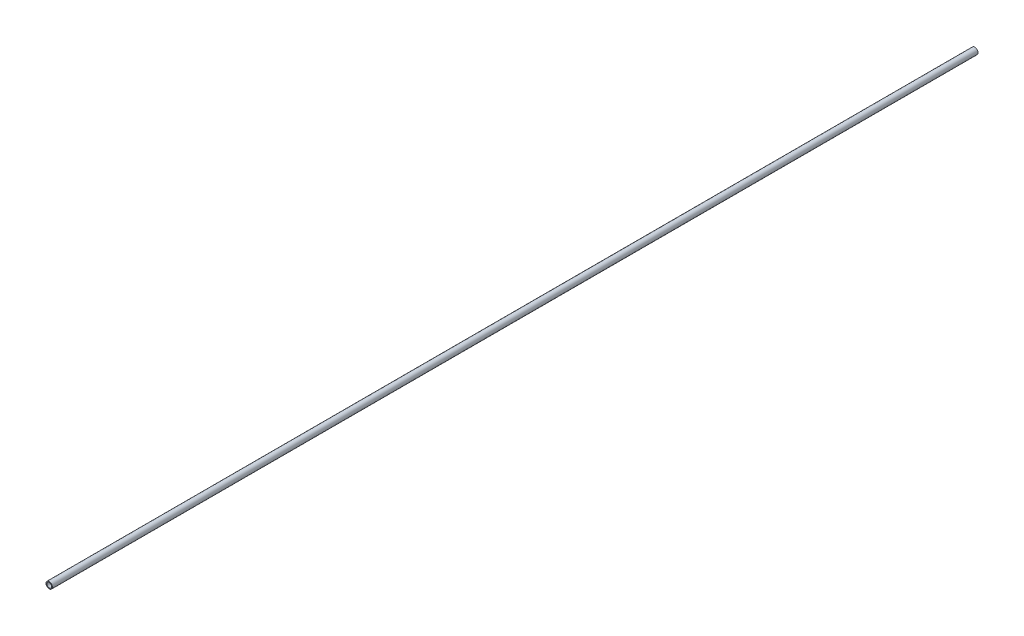
ISO-10303-21;
HEADER;
FILE_DESCRIPTION(('STEP AP214'),'2;1');
FILE_NAME('part.step','',(''),(''),'','','');
FILE_SCHEMA(('AUTOMOTIVE_DESIGN { 1 0 10303 214 1 1 1 1 }'));
ENDSEC;
DATA;
#1=APPLICATION_CONTEXT('core data for automotive mechanical design processes');
#2=APPLICATION_PROTOCOL_DEFINITION('international standard','automotive_design',2000,#1);
#3=PRODUCT_CONTEXT('',#1,'mechanical');
#4=PRODUCT('Part','Part','',(#3));
#5=PRODUCT_RELATED_PRODUCT_CATEGORY('part','',(#4));
#6=PRODUCT_DEFINITION_FORMATION('','',#4);
#7=PRODUCT_DEFINITION_CONTEXT('part definition',#1,'design');
#8=PRODUCT_DEFINITION('design','',#6,#7);
#9=PRODUCT_DEFINITION_SHAPE('','',#8);
#10=(LENGTH_UNIT() NAMED_UNIT(*) SI_UNIT(.MILLI.,.METRE.));
#11=(NAMED_UNIT(*) PLANE_ANGLE_UNIT() SI_UNIT($,.RADIAN.));
#12=(NAMED_UNIT(*) SI_UNIT($,.STERADIAN.) SOLID_ANGLE_UNIT());
#13=UNCERTAINTY_MEASURE_WITH_UNIT(LENGTH_MEASURE(1.E-05),#10,'distance_accuracy_value','');
#14=(GEOMETRIC_REPRESENTATION_CONTEXT(3) GLOBAL_UNCERTAINTY_ASSIGNED_CONTEXT((#13)) GLOBAL_UNIT_ASSIGNED_CONTEXT((#10,
#11,#12)) REPRESENTATION_CONTEXT('',''));
#15=CARTESIAN_POINT('',(0.,0.,0.));
#16=DIRECTION('',(0.,0.,1.));
#17=DIRECTION('',(1.,0.,0.));
#18=AXIS2_PLACEMENT_3D('',#15,#16,#17);
#19=CARTESIAN_POINT('',(0.,0.,1828.8));
#20=DIRECTION('',(0.,0.,1.));
#21=DIRECTION('',(1.,0.,0.));
#22=AXIS2_PLACEMENT_3D('',#19,#20,#21);
#23=PLANE('',#22);
#24=CARTESIAN_POINT('',(0.,0.,1828.8));
#25=DIRECTION('',(0.,0.,1.));
#26=DIRECTION('',(1.,0.,0.));
#27=AXIS2_PLACEMENT_3D('',#24,#25,#26);
#28=CIRCLE('',#27,6.35);
#29=CARTESIAN_POINT('',(6.35,0.,1828.8));
#30=VERTEX_POINT('',#29);
#31=EDGE_CURVE('E10',#30,#30,#28,.T.);
#32=ORIENTED_EDGE('',*,*,#31,.T.);
#33=EDGE_LOOP('',(#32));
#34=FACE_BOUND('',#33,.T.);
#35=CARTESIAN_POINT('',(0.,0.,1828.8));
#36=DIRECTION('',(0.,0.,1.));
#37=DIRECTION('',(1.,0.,0.));
#38=AXIS2_PLACEMENT_3D('',#35,#36,#37);
#39=CIRCLE('',#38,4.699);
#40=CARTESIAN_POINT('',(4.699,0.,1828.8));
#41=VERTEX_POINT('',#40);
#42=EDGE_CURVE('E42',#41,#41,#39,.T.);
#43=ORIENTED_EDGE('',*,*,#42,.F.);
#44=EDGE_LOOP('',(#43));
#45=FACE_BOUND('',#44,.T.);
#46=ADVANCED_FACE('F31',(#34,#45),#23,.T.);
#47=CARTESIAN_POINT('',(0.,0.,0.));
#48=DIRECTION('',(0.,0.,1.));
#49=DIRECTION('',(1.,0.,0.));
#50=AXIS2_PLACEMENT_3D('',#47,#48,#49);
#51=PLANE('',#50);
#52=CARTESIAN_POINT('',(0.,0.,0.));
#53=DIRECTION('',(0.,0.,1.));
#54=DIRECTION('',(1.,0.,0.));
#55=AXIS2_PLACEMENT_3D('',#52,#53,#54);
#56=CIRCLE('',#55,6.35);
#57=CARTESIAN_POINT('',(6.35,0.,0.));
#58=VERTEX_POINT('',#57);
#59=EDGE_CURVE('E35',#58,#58,#56,.T.);
#60=ORIENTED_EDGE('',*,*,#59,.F.);
#61=EDGE_LOOP('',(#60));
#62=FACE_BOUND('',#61,.T.);
#63=CARTESIAN_POINT('',(0.,0.,0.));
#64=DIRECTION('',(0.,0.,1.));
#65=DIRECTION('',(1.,0.,0.));
#66=AXIS2_PLACEMENT_3D('',#63,#64,#65);
#67=CIRCLE('',#66,4.699);
#68=CARTESIAN_POINT('',(4.699,0.,0.));
#69=VERTEX_POINT('',#68);
#70=EDGE_CURVE('E44',#69,#69,#67,.T.);
#71=ORIENTED_EDGE('',*,*,#70,.T.);
#72=EDGE_LOOP('',(#71));
#73=FACE_BOUND('',#72,.T.);
#74=ADVANCED_FACE('F54',(#62,#73),#51,.F.);
#75=CARTESIAN_POINT('',(0.,0.,1828.8));
#76=DIRECTION('',(0.,0.,-1.));
#77=DIRECTION('',(-1.,0.,0.));
#78=AXIS2_PLACEMENT_3D('',#75,#76,#77);
#79=CYLINDRICAL_SURFACE('',#78,6.35);
#80=ORIENTED_EDGE('',*,*,#31,.F.);
#81=EDGE_LOOP('',(#80));
#82=FACE_BOUND('',#81,.T.);
#83=ORIENTED_EDGE('',*,*,#59,.T.);
#84=EDGE_LOOP('',(#83));
#85=FACE_BOUND('',#84,.T.);
#86=ADVANCED_FACE('F33',(#82,#85),#79,.T.);
#87=CARTESIAN_POINT('',(0.,0.,1828.8));
#88=DIRECTION('',(0.,0.,-1.));
#89=DIRECTION('',(-1.,0.,0.));
#90=AXIS2_PLACEMENT_3D('',#87,#88,#89);
#91=CYLINDRICAL_SURFACE('',#90,4.699);
#92=ORIENTED_EDGE('',*,*,#42,.T.);
#93=EDGE_LOOP('',(#92));
#94=FACE_BOUND('',#93,.T.);
#95=ORIENTED_EDGE('',*,*,#70,.F.);
#96=EDGE_LOOP('',(#95));
#97=FACE_BOUND('',#96,.T.);
#98=ADVANCED_FACE('F50',(#94,#97),#91,.F.);
#99=CLOSED_SHELL('',(#46,#74,#86,#98));
#100=MANIFOLD_SOLID_BREP('B2',#99);
#101=ADVANCED_BREP_SHAPE_REPRESENTATION('',(#18,#100),#14);
#102=SHAPE_DEFINITION_REPRESENTATION(#9,#101);
ENDSEC;
END-ISO-10303-21;
